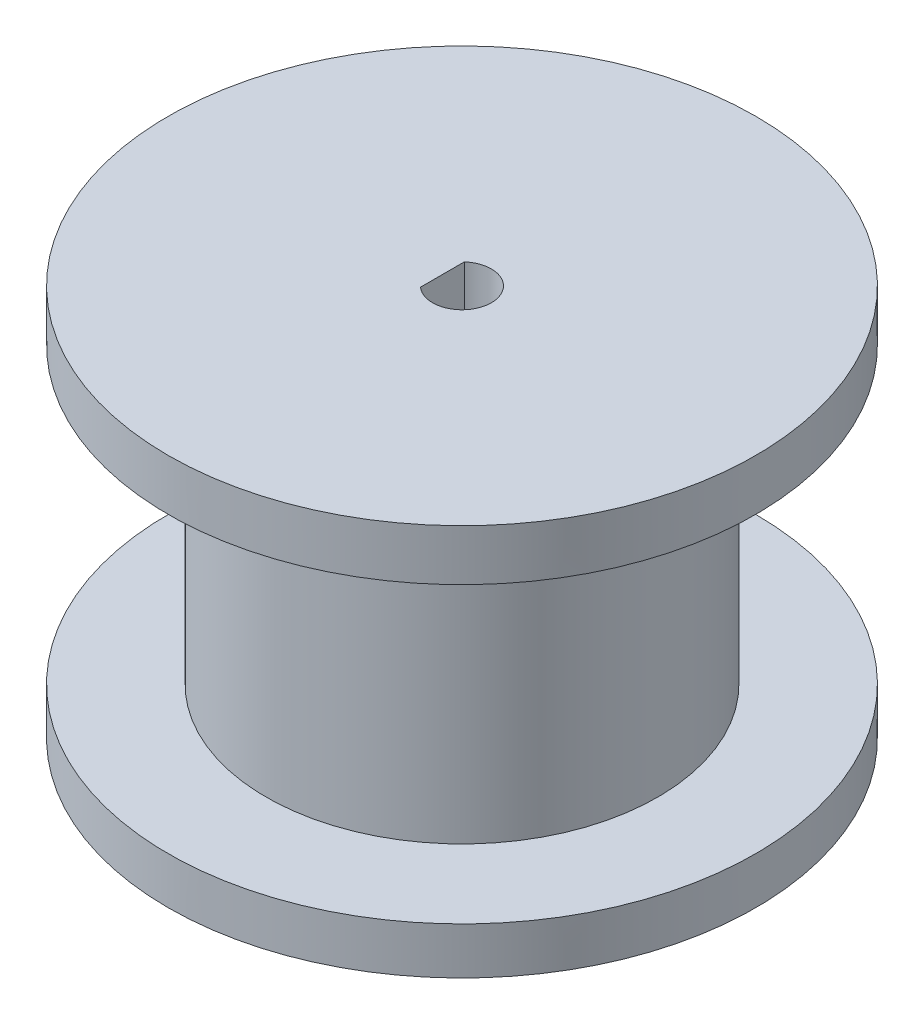
ISO-10303-21;
HEADER;
FILE_DESCRIPTION(('STEP AP214'),'2;1');
FILE_NAME('part.step','',(''),(''),'','','');
FILE_SCHEMA(('AUTOMOTIVE_DESIGN { 1 0 10303 214 1 1 1 1 }'));
ENDSEC;
DATA;
#1=APPLICATION_CONTEXT('core data for automotive mechanical design processes');
#2=APPLICATION_PROTOCOL_DEFINITION('international standard','automotive_design',2000,#1);
#3=PRODUCT_CONTEXT('',#1,'mechanical');
#4=PRODUCT('Part','Part','',(#3));
#5=PRODUCT_RELATED_PRODUCT_CATEGORY('part','',(#4));
#6=PRODUCT_DEFINITION_FORMATION('','',#4);
#7=PRODUCT_DEFINITION_CONTEXT('part definition',#1,'design');
#8=PRODUCT_DEFINITION('design','',#6,#7);
#9=PRODUCT_DEFINITION_SHAPE('','',#8);
#10=(LENGTH_UNIT() NAMED_UNIT(*) SI_UNIT(.MILLI.,.METRE.));
#11=(NAMED_UNIT(*) PLANE_ANGLE_UNIT() SI_UNIT($,.RADIAN.));
#12=(NAMED_UNIT(*) SI_UNIT($,.STERADIAN.) SOLID_ANGLE_UNIT());
#13=UNCERTAINTY_MEASURE_WITH_UNIT(LENGTH_MEASURE(1.E-05),#10,'distance_accuracy_value','');
#14=(GEOMETRIC_REPRESENTATION_CONTEXT(3) GLOBAL_UNCERTAINTY_ASSIGNED_CONTEXT((#13)) GLOBAL_UNIT_ASSIGNED_CONTEXT((#10,
#11,#12)) REPRESENTATION_CONTEXT('',''));
#15=CARTESIAN_POINT('',(0.,0.,0.));
#16=DIRECTION('',(0.,0.,1.));
#17=DIRECTION('',(1.,0.,0.));
#18=AXIS2_PLACEMENT_3D('',#15,#16,#17);
#19=CARTESIAN_POINT('',(0.,20.,0.));
#20=DIRECTION('',(0.,-1.,0.));
#21=DIRECTION('',(0.,0.,-1.));
#22=AXIS2_PLACEMENT_3D('',#19,#20,#21);
#23=CYLINDRICAL_SURFACE('',#22,15.);
#24=CARTESIAN_POINT('',(0.,17.3920213614737,0.));
#25=DIRECTION('',(0.,-1.,0.));
#26=DIRECTION('',(0.,0.,-1.));
#27=AXIS2_PLACEMENT_3D('',#24,#25,#26);
#28=CIRCLE('',#27,15.);
#29=CARTESIAN_POINT('',(0.,17.3920213614737,-15.));
#30=VERTEX_POINT('',#29);
#31=EDGE_CURVE('E96',#30,#30,#28,.T.);
#32=ORIENTED_EDGE('',*,*,#31,.F.);
#33=EDGE_LOOP('',(#32));
#34=FACE_BOUND('',#33,.T.);
#35=CARTESIAN_POINT('',(0.,20.,0.));
#36=DIRECTION('',(0.,1.,0.));
#37=DIRECTION('',(0.,0.,1.));
#38=AXIS2_PLACEMENT_3D('',#35,#36,#37);
#39=CIRCLE('',#38,15.);
#40=CARTESIAN_POINT('',(0.,20.,15.));
#41=VERTEX_POINT('',#40);
#42=EDGE_CURVE('E70',#41,#41,#39,.T.);
#43=ORIENTED_EDGE('',*,*,#42,.F.);
#44=EDGE_LOOP('',(#43));
#45=FACE_BOUND('',#44,.T.);
#46=ADVANCED_FACE('F41',(#34,#45),#23,.T.);
#47=CARTESIAN_POINT('',(-1.,20.,0.));
#48=DIRECTION('',(-1.,0.,0.));
#49=DIRECTION('',(0.,0.,1.));
#50=AXIS2_PLACEMENT_3D('',#47,#48,#49);
#51=PLANE('',#50);
#52=DIRECTION('',(0.,0.,-1.));
#53=VECTOR('',#52,1.);
#54=CARTESIAN_POINT('',(-1.,0.,0.));
#55=LINE('',#54,#53);
#56=CARTESIAN_POINT('',(-1.,0.,1.1180339887499));
#57=VERTEX_POINT('',#56);
#58=CARTESIAN_POINT('',(-1.,0.,-1.1180339887499));
#59=VERTEX_POINT('',#58);
#60=EDGE_CURVE('E66',#57,#59,#55,.T.);
#61=ORIENTED_EDGE('',*,*,#60,.T.);
#62=DIRECTION('',(0.,-1.,0.));
#63=VECTOR('',#62,1.);
#64=CARTESIAN_POINT('',(-1.,20.,-1.1180339887499));
#65=LINE('',#64,#63);
#66=CARTESIAN_POINT('',(-1.,20.,-1.1180339887499));
#67=VERTEX_POINT('',#66);
#68=EDGE_CURVE('E11',#67,#59,#65,.T.);
#69=ORIENTED_EDGE('',*,*,#68,.F.);
#70=DIRECTION('',(0.,0.,-1.));
#71=VECTOR('',#70,1.);
#72=CARTESIAN_POINT('',(-1.,20.,0.));
#73=LINE('',#72,#71);
#74=CARTESIAN_POINT('',(-1.,20.,1.1180339887499));
#75=VERTEX_POINT('',#74);
#76=EDGE_CURVE('E68',#75,#67,#73,.T.);
#77=ORIENTED_EDGE('',*,*,#76,.F.);
#78=DIRECTION('',(0.,-1.,0.));
#79=VECTOR('',#78,1.);
#80=CARTESIAN_POINT('',(-1.,20.,1.1180339887499));
#81=LINE('',#80,#79);
#82=EDGE_CURVE('E50',#75,#57,#81,.T.);
#83=ORIENTED_EDGE('',*,*,#82,.T.);
#84=EDGE_LOOP('',(#61,#69,#77,#83));
#85=FACE_BOUND('',#84,.T.);
#86=ADVANCED_FACE('F43',(#85),#51,.F.);
#87=CARTESIAN_POINT('',(0.,20.,0.));
#88=DIRECTION('',(0.,-1.,0.));
#89=DIRECTION('',(0.,0.,-1.));
#90=AXIS2_PLACEMENT_3D('',#87,#88,#89);
#91=CYLINDRICAL_SURFACE('',#90,1.5);
#92=CARTESIAN_POINT('',(0.,0.,0.));
#93=DIRECTION('',(0.,1.,0.));
#94=DIRECTION('',(0.,0.,1.));
#95=AXIS2_PLACEMENT_3D('',#92,#93,#94);
#96=CIRCLE('',#95,1.5);
#97=EDGE_CURVE('E74',#57,#59,#96,.T.);
#98=ORIENTED_EDGE('',*,*,#97,.F.);
#99=ORIENTED_EDGE('',*,*,#82,.F.);
#100=CARTESIAN_POINT('',(0.,20.,0.));
#101=DIRECTION('',(0.,1.,0.));
#102=DIRECTION('',(0.,0.,1.));
#103=AXIS2_PLACEMENT_3D('',#100,#101,#102);
#104=CIRCLE('',#103,1.5);
#105=EDGE_CURVE('E85',#75,#67,#104,.T.);
#106=ORIENTED_EDGE('',*,*,#105,.T.);
#107=ORIENTED_EDGE('',*,*,#68,.T.);
#108=EDGE_LOOP('',(#98,#99,#106,#107));
#109=FACE_BOUND('',#108,.T.);
#110=ADVANCED_FACE('F77',(#109),#91,.F.);
#111=CARTESIAN_POINT('',(0.,2.39202136147373,0.));
#112=DIRECTION('',(0.,-1.,0.));
#113=DIRECTION('',(0.,0.,-1.));
#114=AXIS2_PLACEMENT_3D('',#111,#112,#113);
#115=CIRCLE('',#114,15.);
#116=CARTESIAN_POINT('',(0.,2.39202136147373,-15.));
#117=VERTEX_POINT('',#116);
#118=EDGE_CURVE('E93',#117,#117,#115,.T.);
#119=ORIENTED_EDGE('',*,*,#118,.T.);
#120=EDGE_LOOP('',(#119));
#121=FACE_BOUND('',#120,.T.);
#122=CARTESIAN_POINT('',(0.,0.,0.));
#123=DIRECTION('',(0.,1.,0.));
#124=DIRECTION('',(0.,0.,1.));
#125=AXIS2_PLACEMENT_3D('',#122,#123,#124);
#126=CIRCLE('',#125,15.);
#127=CARTESIAN_POINT('',(0.,0.,15.));
#128=VERTEX_POINT('',#127);
#129=EDGE_CURVE('E78',#128,#128,#126,.T.);
#130=ORIENTED_EDGE('',*,*,#129,.T.);
#131=EDGE_LOOP('',(#130));
#132=FACE_BOUND('',#131,.T.);
#133=ADVANCED_FACE('F105',(#121,#132),#23,.T.);
#134=CARTESIAN_POINT('',(0.,20.,0.));
#135=DIRECTION('',(0.,1.,0.));
#136=DIRECTION('',(0.,0.,1.));
#137=AXIS2_PLACEMENT_3D('',#134,#135,#136);
#138=PLANE('',#137);
#139=ORIENTED_EDGE('',*,*,#76,.T.);
#140=ORIENTED_EDGE('',*,*,#105,.F.);
#141=EDGE_LOOP('',(#139,#140));
#142=FACE_BOUND('',#141,.T.);
#143=ORIENTED_EDGE('',*,*,#42,.T.);
#144=EDGE_LOOP('',(#143));
#145=FACE_BOUND('',#144,.T.);
#146=ADVANCED_FACE('F108',(#142,#145),#138,.T.);
#147=CARTESIAN_POINT('',(0.,0.,0.));
#148=DIRECTION('',(0.,1.,0.));
#149=DIRECTION('',(0.,0.,1.));
#150=AXIS2_PLACEMENT_3D('',#147,#148,#149);
#151=PLANE('',#150);
#152=ORIENTED_EDGE('',*,*,#60,.F.);
#153=ORIENTED_EDGE('',*,*,#97,.T.);
#154=EDGE_LOOP('',(#152,#153));
#155=FACE_BOUND('',#154,.T.);
#156=ORIENTED_EDGE('',*,*,#129,.F.);
#157=EDGE_LOOP('',(#156));
#158=FACE_BOUND('',#157,.T.);
#159=ADVANCED_FACE('F72',(#155,#158),#151,.F.);
#160=CARTESIAN_POINT('',(15.,17.3920213614737,0.));
#161=DIRECTION('',(0.,1.,0.));
#162=DIRECTION('',(0.,0.,1.));
#163=AXIS2_PLACEMENT_3D('',#160,#161,#162);
#164=PLANE('',#163);
#165=CARTESIAN_POINT('',(0.,17.3920213614737,0.));
#166=DIRECTION('',(0.,-1.,0.));
#167=DIRECTION('',(0.,0.,-1.));
#168=AXIS2_PLACEMENT_3D('',#165,#166,#167);
#169=CIRCLE('',#168,10.);
#170=CARTESIAN_POINT('',(0.,17.3920213614737,-10.));
#171=VERTEX_POINT('',#170);
#172=EDGE_CURVE('E75',#171,#171,#169,.T.);
#173=ORIENTED_EDGE('',*,*,#172,.F.);
#174=EDGE_LOOP('',(#173));
#175=FACE_BOUND('',#174,.T.);
#176=ORIENTED_EDGE('',*,*,#31,.T.);
#177=EDGE_LOOP('',(#176));
#178=FACE_BOUND('',#177,.T.);
#179=ADVANCED_FACE('F100',(#175,#178),#164,.F.);
#180=CARTESIAN_POINT('',(0.,0.,0.));
#181=DIRECTION('',(0.,-1.,0.));
#182=DIRECTION('',(0.,0.,-1.));
#183=AXIS2_PLACEMENT_3D('',#180,#181,#182);
#184=CYLINDRICAL_SURFACE('',#183,10.);
#185=CARTESIAN_POINT('',(0.,2.39202136147373,0.));
#186=DIRECTION('',(0.,-1.,0.));
#187=DIRECTION('',(0.,0.,-1.));
#188=AXIS2_PLACEMENT_3D('',#185,#186,#187);
#189=CIRCLE('',#188,10.);
#190=CARTESIAN_POINT('',(0.,2.39202136147373,-10.));
#191=VERTEX_POINT('',#190);
#192=EDGE_CURVE('E90',#191,#191,#189,.T.);
#193=ORIENTED_EDGE('',*,*,#192,.F.);
#194=EDGE_LOOP('',(#193));
#195=FACE_BOUND('',#194,.T.);
#196=ORIENTED_EDGE('',*,*,#172,.T.);
#197=EDGE_LOOP('',(#196));
#198=FACE_BOUND('',#197,.T.);
#199=ADVANCED_FACE('F150',(#195,#198),#184,.T.);
#200=CARTESIAN_POINT('',(10.,2.39202136147373,0.));
#201=DIRECTION('',(0.,-1.,0.));
#202=DIRECTION('',(0.,0.,-1.));
#203=AXIS2_PLACEMENT_3D('',#200,#201,#202);
#204=PLANE('',#203);
#205=ORIENTED_EDGE('',*,*,#118,.F.);
#206=EDGE_LOOP('',(#205));
#207=FACE_BOUND('',#206,.T.);
#208=ORIENTED_EDGE('',*,*,#192,.T.);
#209=EDGE_LOOP('',(#208));
#210=FACE_BOUND('',#209,.T.);
#211=ADVANCED_FACE('F159',(#207,#210),#204,.F.);
#212=CLOSED_SHELL('',(#46,#86,#110,#133,#146,#159,#179,#199,#211));
#213=MANIFOLD_SOLID_BREP('B2',#212);
#214=ADVANCED_BREP_SHAPE_REPRESENTATION('',(#18,#213),#14);
#215=SHAPE_DEFINITION_REPRESENTATION(#9,#214);
ENDSEC;
END-ISO-10303-21;
